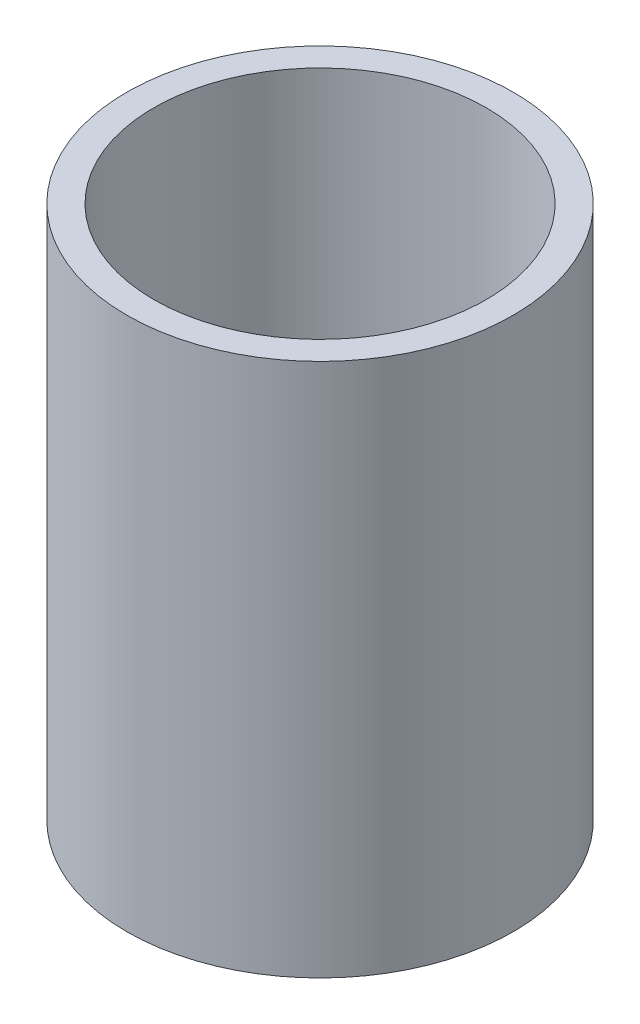
ISO-10303-21;
HEADER;
FILE_DESCRIPTION(('STEP AP214'),'2;1');
FILE_NAME('part.step','',(''),(''),'','','');
FILE_SCHEMA(('AUTOMOTIVE_DESIGN { 1 0 10303 214 1 1 1 1 }'));
ENDSEC;
DATA;
#1=APPLICATION_CONTEXT('core data for automotive mechanical design processes');
#2=APPLICATION_PROTOCOL_DEFINITION('international standard','automotive_design',2000,#1);
#3=PRODUCT_CONTEXT('',#1,'mechanical');
#4=PRODUCT('Part','Part','',(#3));
#5=PRODUCT_RELATED_PRODUCT_CATEGORY('part','',(#4));
#6=PRODUCT_DEFINITION_FORMATION('','',#4);
#7=PRODUCT_DEFINITION_CONTEXT('part definition',#1,'design');
#8=PRODUCT_DEFINITION('design','',#6,#7);
#9=PRODUCT_DEFINITION_SHAPE('','',#8);
#10=(LENGTH_UNIT() NAMED_UNIT(*) SI_UNIT(.MILLI.,.METRE.));
#11=(NAMED_UNIT(*) PLANE_ANGLE_UNIT() SI_UNIT($,.RADIAN.));
#12=(NAMED_UNIT(*) SI_UNIT($,.STERADIAN.) SOLID_ANGLE_UNIT());
#13=UNCERTAINTY_MEASURE_WITH_UNIT(LENGTH_MEASURE(1.E-05),#10,'distance_accuracy_value','');
#14=(GEOMETRIC_REPRESENTATION_CONTEXT(3) GLOBAL_UNCERTAINTY_ASSIGNED_CONTEXT((#13)) GLOBAL_UNIT_ASSIGNED_CONTEXT((#10,
#11,#12)) REPRESENTATION_CONTEXT('',''));
#15=CARTESIAN_POINT('',(0.,0.,0.));
#16=DIRECTION('',(0.,0.,1.));
#17=DIRECTION('',(1.,0.,0.));
#18=AXIS2_PLACEMENT_3D('',#15,#16,#17);
#19=CARTESIAN_POINT('',(0.,131.274104424482,0.));
#20=DIRECTION('',(0.,-1.,0.));
#21=DIRECTION('',(0.,0.,-1.));
#22=AXIS2_PLACEMENT_3D('',#19,#20,#21);
#23=CYLINDRICAL_SURFACE('',#22,47.5);
#24=CARTESIAN_POINT('',(0.,131.274104424482,0.));
#25=DIRECTION('',(0.,1.,0.));
#26=DIRECTION('',(0.,0.,1.));
#27=AXIS2_PLACEMENT_3D('',#24,#25,#26);
#28=CIRCLE('',#27,47.5);
#29=CARTESIAN_POINT('',(0.,131.274104424482,47.5));
#30=VERTEX_POINT('',#29);
#31=EDGE_CURVE('E10',#30,#30,#28,.T.);
#32=ORIENTED_EDGE('',*,*,#31,.F.);
#33=EDGE_LOOP('',(#32));
#34=FACE_BOUND('',#33,.T.);
#35=CARTESIAN_POINT('',(0.,0.,0.));
#36=DIRECTION('',(0.,1.,0.));
#37=DIRECTION('',(0.,0.,1.));
#38=AXIS2_PLACEMENT_3D('',#35,#36,#37);
#39=CIRCLE('',#38,47.5);
#40=CARTESIAN_POINT('',(0.,0.,47.5));
#41=VERTEX_POINT('',#40);
#42=EDGE_CURVE('E37',#41,#41,#39,.T.);
#43=ORIENTED_EDGE('',*,*,#42,.T.);
#44=EDGE_LOOP('',(#43));
#45=FACE_BOUND('',#44,.T.);
#46=ADVANCED_FACE('F40',(#34,#45),#23,.T.);
#47=CARTESIAN_POINT('',(0.,131.274104424482,0.));
#48=DIRECTION('',(0.,1.,0.));
#49=DIRECTION('',(0.,0.,1.));
#50=AXIS2_PLACEMENT_3D('',#47,#48,#49);
#51=PLANE('',#50);
#52=CARTESIAN_POINT('',(0.,131.274104424482,0.));
#53=DIRECTION('',(0.,1.,0.));
#54=DIRECTION('',(0.,0.,1.));
#55=AXIS2_PLACEMENT_3D('',#52,#53,#54);
#56=CIRCLE('',#55,40.866245425504);
#57=CARTESIAN_POINT('',(0.,131.274104424482,40.866245425504));
#58=VERTEX_POINT('',#57);
#59=EDGE_CURVE('E50',#58,#58,#56,.T.);
#60=ORIENTED_EDGE('',*,*,#59,.F.);
#61=EDGE_LOOP('',(#60));
#62=FACE_BOUND('',#61,.T.);
#63=ORIENTED_EDGE('',*,*,#31,.T.);
#64=EDGE_LOOP('',(#63));
#65=FACE_BOUND('',#64,.T.);
#66=ADVANCED_FACE('F59',(#62,#65),#51,.T.);
#67=CARTESIAN_POINT('',(0.,0.,0.));
#68=DIRECTION('',(0.,1.,0.));
#69=DIRECTION('',(0.,0.,1.));
#70=AXIS2_PLACEMENT_3D('',#67,#68,#69);
#71=PLANE('',#70);
#72=CARTESIAN_POINT('',(0.,0.,0.));
#73=DIRECTION('',(0.,1.,0.));
#74=DIRECTION('',(0.,0.,1.));
#75=AXIS2_PLACEMENT_3D('',#72,#73,#74);
#76=CIRCLE('',#75,40.866245425504);
#77=CARTESIAN_POINT('',(0.,0.,40.866245425504));
#78=VERTEX_POINT('',#77);
#79=EDGE_CURVE('E47',#78,#78,#76,.T.);
#80=ORIENTED_EDGE('',*,*,#79,.T.);
#81=EDGE_LOOP('',(#80));
#82=FACE_BOUND('',#81,.T.);
#83=ORIENTED_EDGE('',*,*,#42,.F.);
#84=EDGE_LOOP('',(#83));
#85=FACE_BOUND('',#84,.T.);
#86=ADVANCED_FACE('F58',(#82,#85),#71,.F.);
#87=CARTESIAN_POINT('',(0.,131.274104424482,0.));
#88=DIRECTION('',(0.,-1.,0.));
#89=DIRECTION('',(0.,0.,-1.));
#90=AXIS2_PLACEMENT_3D('',#87,#88,#89);
#91=CYLINDRICAL_SURFACE('',#90,40.866245425504);
#92=ORIENTED_EDGE('',*,*,#59,.T.);
#93=EDGE_LOOP('',(#92));
#94=FACE_BOUND('',#93,.T.);
#95=ORIENTED_EDGE('',*,*,#79,.F.);
#96=EDGE_LOOP('',(#95));
#97=FACE_BOUND('',#96,.T.);
#98=ADVANCED_FACE('F54',(#94,#97),#91,.F.);
#99=CLOSED_SHELL('',(#46,#66,#86,#98));
#100=MANIFOLD_SOLID_BREP('B2',#99);
#101=ADVANCED_BREP_SHAPE_REPRESENTATION('',(#18,#100),#14);
#102=SHAPE_DEFINITION_REPRESENTATION(#9,#101);
ENDSEC;
END-ISO-10303-21;
